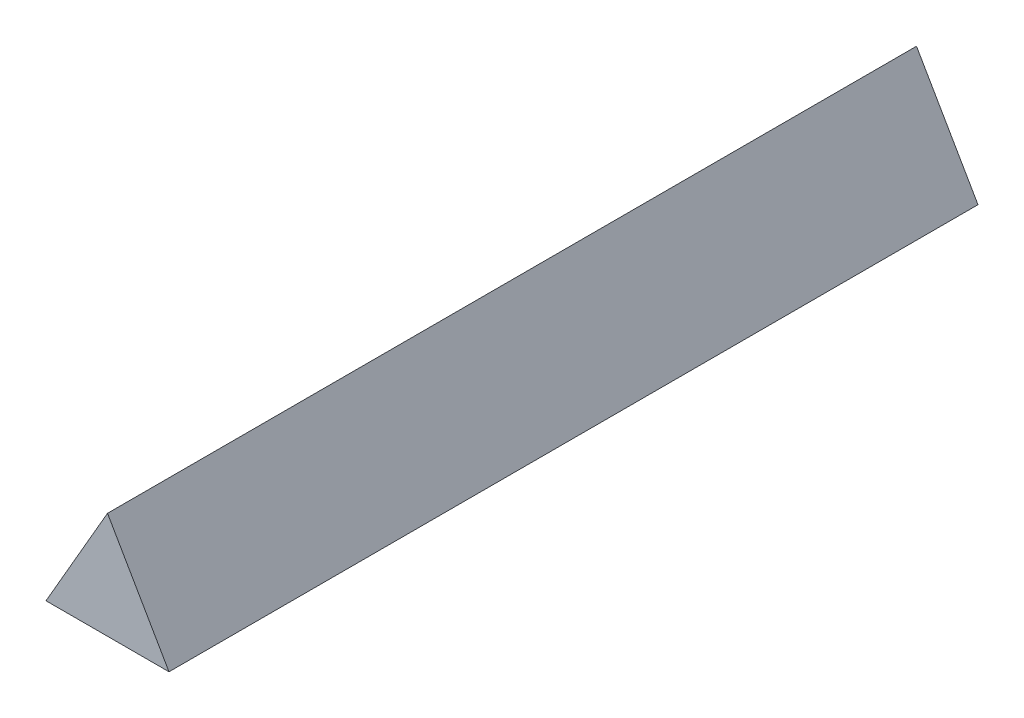
ISO-10303-21;
HEADER;
FILE_DESCRIPTION(('STEP AP214'),'2;1');
FILE_NAME('part.step','',(''),(''),'','','');
FILE_SCHEMA(('AUTOMOTIVE_DESIGN { 1 0 10303 214 1 1 1 1 }'));
ENDSEC;
DATA;
#1=APPLICATION_CONTEXT('core data for automotive mechanical design processes');
#2=APPLICATION_PROTOCOL_DEFINITION('international standard','automotive_design',2000,#1);
#3=PRODUCT_CONTEXT('',#1,'mechanical');
#4=PRODUCT('Part','Part','',(#3));
#5=PRODUCT_RELATED_PRODUCT_CATEGORY('part','',(#4));
#6=PRODUCT_DEFINITION_FORMATION('','',#4);
#7=PRODUCT_DEFINITION_CONTEXT('part definition',#1,'design');
#8=PRODUCT_DEFINITION('design','',#6,#7);
#9=PRODUCT_DEFINITION_SHAPE('','',#8);
#10=(LENGTH_UNIT() NAMED_UNIT(*) SI_UNIT(.MILLI.,.METRE.));
#11=(NAMED_UNIT(*) PLANE_ANGLE_UNIT() SI_UNIT($,.RADIAN.));
#12=(NAMED_UNIT(*) SI_UNIT($,.STERADIAN.) SOLID_ANGLE_UNIT());
#13=UNCERTAINTY_MEASURE_WITH_UNIT(LENGTH_MEASURE(1.E-05),#10,'distance_accuracy_value','');
#14=(GEOMETRIC_REPRESENTATION_CONTEXT(3) GLOBAL_UNCERTAINTY_ASSIGNED_CONTEXT((#13)) GLOBAL_UNIT_ASSIGNED_CONTEXT((#10,
#11,#12)) REPRESENTATION_CONTEXT('',''));
#15=CARTESIAN_POINT('',(0.,0.,0.));
#16=DIRECTION('',(0.,0.,1.));
#17=DIRECTION('',(1.,0.,0.));
#18=AXIS2_PLACEMENT_3D('',#15,#16,#17);
#19=CARTESIAN_POINT('',(-4.56106712659804,0.,60.));
#20=DIRECTION('',(0.,1.,0.));
#21=DIRECTION('',(-1.,0.,0.));
#22=AXIS2_PLACEMENT_3D('',#19,#20,#21);
#23=PLANE('',#22);
#24=DIRECTION('',(1.,0.,0.));
#25=VECTOR('',#24,1.);
#26=CARTESIAN_POINT('',(-4.56106712659804,0.,0.));
#27=LINE('',#26,#25);
#28=CARTESIAN_POINT('',(-4.56106712659804,0.,0.));
#29=VERTEX_POINT('',#28);
#30=CARTESIAN_POINT('',(4.56106712659804,0.,0.));
#31=VERTEX_POINT('',#30);
#32=EDGE_CURVE('E89',#29,#31,#27,.T.);
#33=ORIENTED_EDGE('',*,*,#32,.T.);
#34=DIRECTION('',(0.,0.,-1.));
#35=VECTOR('',#34,1.);
#36=CARTESIAN_POINT('',(4.56106712659804,0.,60.));
#37=LINE('',#36,#35);
#38=CARTESIAN_POINT('',(4.56106712659804,0.,60.));
#39=VERTEX_POINT('',#38);
#40=EDGE_CURVE('E11',#39,#31,#37,.T.);
#41=ORIENTED_EDGE('',*,*,#40,.F.);
#42=DIRECTION('',(1.,0.,0.));
#43=VECTOR('',#42,1.);
#44=CARTESIAN_POINT('',(-4.56106712659804,0.,60.));
#45=LINE('',#44,#43);
#46=CARTESIAN_POINT('',(-4.56106712659804,0.,60.));
#47=VERTEX_POINT('',#46);
#48=EDGE_CURVE('E81',#47,#39,#45,.T.);
#49=ORIENTED_EDGE('',*,*,#48,.F.);
#50=DIRECTION('',(0.,0.,-1.));
#51=VECTOR('',#50,1.);
#52=CARTESIAN_POINT('',(-4.56106712659804,0.,60.));
#53=LINE('',#52,#51);
#54=EDGE_CURVE('E90',#47,#29,#53,.T.);
#55=ORIENTED_EDGE('',*,*,#54,.T.);
#56=EDGE_LOOP('',(#33,#41,#49,#55));
#57=FACE_BOUND('',#56,.T.);
#58=ADVANCED_FACE('F39',(#57),#23,.F.);
#59=CARTESIAN_POINT('',(4.56106712659804,0.,60.));
#60=DIRECTION('',(-0.866025403784439,-0.5,0.));
#61=DIRECTION('',(0.5,-0.866025403784439,0.));
#62=AXIS2_PLACEMENT_3D('',#59,#60,#61);
#63=PLANE('',#62);
#64=DIRECTION('',(-0.5,0.866025403784439,0.));
#65=VECTOR('',#64,1.);
#66=CARTESIAN_POINT('',(4.56106712659804,0.,0.));
#67=LINE('',#66,#65);
#68=CARTESIAN_POINT('',(0.,7.9,0.));
#69=VERTEX_POINT('',#68);
#70=EDGE_CURVE('E68',#31,#69,#67,.T.);
#71=ORIENTED_EDGE('',*,*,#70,.T.);
#72=DIRECTION('',(0.,0.,-1.));
#73=VECTOR('',#72,1.);
#74=CARTESIAN_POINT('',(0.,7.9,60.));
#75=LINE('',#74,#73);
#76=CARTESIAN_POINT('',(0.,7.9,60.));
#77=VERTEX_POINT('',#76);
#78=EDGE_CURVE('E48',#77,#69,#75,.T.);
#79=ORIENTED_EDGE('',*,*,#78,.F.);
#80=DIRECTION('',(-0.5,0.866025403784439,0.));
#81=VECTOR('',#80,1.);
#82=CARTESIAN_POINT('',(4.56106712659804,0.,60.));
#83=LINE('',#82,#81);
#84=EDGE_CURVE('E76',#39,#77,#83,.T.);
#85=ORIENTED_EDGE('',*,*,#84,.F.);
#86=ORIENTED_EDGE('',*,*,#40,.T.);
#87=EDGE_LOOP('',(#71,#79,#85,#86));
#88=FACE_BOUND('',#87,.T.);
#89=ADVANCED_FACE('F77',(#88),#63,.F.);
#90=CARTESIAN_POINT('',(0.,7.9,60.));
#91=DIRECTION('',(0.866025403784439,-0.5,0.));
#92=DIRECTION('',(0.5,0.866025403784439,0.));
#93=AXIS2_PLACEMENT_3D('',#90,#91,#92);
#94=PLANE('',#93);
#95=DIRECTION('',(-0.5,-0.866025403784439,0.));
#96=VECTOR('',#95,1.);
#97=CARTESIAN_POINT('',(0.,7.9,0.));
#98=LINE('',#97,#96);
#99=EDGE_CURVE('E73',#69,#29,#98,.T.);
#100=ORIENTED_EDGE('',*,*,#99,.T.);
#101=ORIENTED_EDGE('',*,*,#54,.F.);
#102=DIRECTION('',(-0.5,-0.866025403784439,0.));
#103=VECTOR('',#102,1.);
#104=CARTESIAN_POINT('',(0.,7.9,60.));
#105=LINE('',#104,#103);
#106=EDGE_CURVE('E56',#77,#47,#105,.T.);
#107=ORIENTED_EDGE('',*,*,#106,.F.);
#108=ORIENTED_EDGE('',*,*,#78,.T.);
#109=EDGE_LOOP('',(#100,#101,#107,#108));
#110=FACE_BOUND('',#109,.T.);
#111=ADVANCED_FACE('F102',(#110),#94,.F.);
#112=CARTESIAN_POINT('',(0.,0.,60.));
#113=DIRECTION('',(0.,0.,1.));
#114=DIRECTION('',(1.,0.,0.));
#115=AXIS2_PLACEMENT_3D('',#112,#113,#114);
#116=PLANE('',#115);
#117=ORIENTED_EDGE('',*,*,#48,.T.);
#118=ORIENTED_EDGE('',*,*,#84,.T.);
#119=ORIENTED_EDGE('',*,*,#106,.T.);
#120=EDGE_LOOP('',(#117,#118,#119));
#121=FACE_BOUND('',#120,.T.);
#122=ADVANCED_FACE('F84',(#121),#116,.T.);
#123=CARTESIAN_POINT('',(0.,0.,0.));
#124=DIRECTION('',(0.,0.,1.));
#125=DIRECTION('',(1.,0.,0.));
#126=AXIS2_PLACEMENT_3D('',#123,#124,#125);
#127=PLANE('',#126);
#128=ORIENTED_EDGE('',*,*,#32,.F.);
#129=ORIENTED_EDGE('',*,*,#99,.F.);
#130=ORIENTED_EDGE('',*,*,#70,.F.);
#131=EDGE_LOOP('',(#128,#129,#130));
#132=FACE_BOUND('',#131,.T.);
#133=ADVANCED_FACE('F103',(#132),#127,.F.);
#134=CLOSED_SHELL('',(#58,#89,#111,#122,#133));
#135=MANIFOLD_SOLID_BREP('B2',#134);
#136=ADVANCED_BREP_SHAPE_REPRESENTATION('',(#18,#135),#14);
#137=SHAPE_DEFINITION_REPRESENTATION(#9,#136);
ENDSEC;
END-ISO-10303-21;
